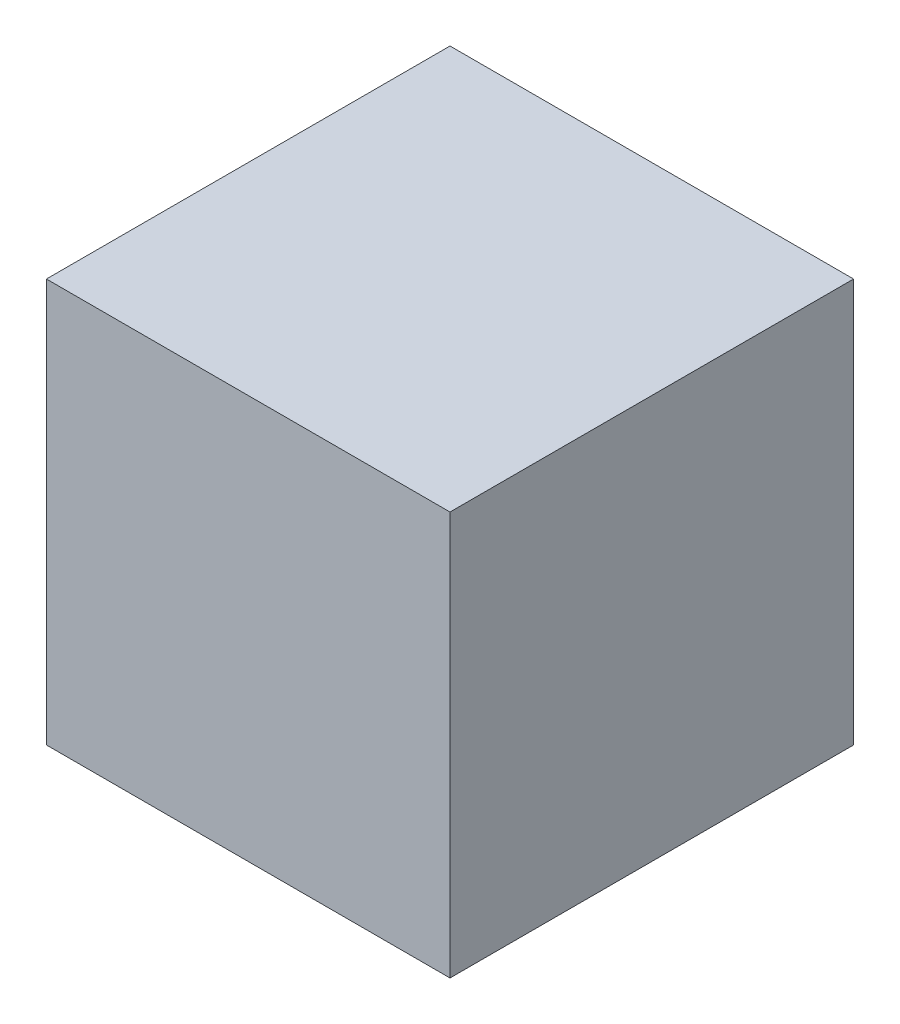
ISO-10303-21;
HEADER;
FILE_DESCRIPTION(('STEP AP214'),'2;1');
FILE_NAME('part.step','',(''),(''),'','','');
FILE_SCHEMA(('AUTOMOTIVE_DESIGN { 1 0 10303 214 1 1 1 1 }'));
ENDSEC;
DATA;
#1=APPLICATION_CONTEXT('core data for automotive mechanical design processes');
#2=APPLICATION_PROTOCOL_DEFINITION('international standard','automotive_design',2000,#1);
#3=PRODUCT_CONTEXT('',#1,'mechanical');
#4=PRODUCT('Part','Part','',(#3));
#5=PRODUCT_RELATED_PRODUCT_CATEGORY('part','',(#4));
#6=PRODUCT_DEFINITION_FORMATION('','',#4);
#7=PRODUCT_DEFINITION_CONTEXT('part definition',#1,'design');
#8=PRODUCT_DEFINITION('design','',#6,#7);
#9=PRODUCT_DEFINITION_SHAPE('','',#8);
#10=(LENGTH_UNIT() NAMED_UNIT(*) SI_UNIT(.MILLI.,.METRE.));
#11=(NAMED_UNIT(*) PLANE_ANGLE_UNIT() SI_UNIT($,.RADIAN.));
#12=(NAMED_UNIT(*) SI_UNIT($,.STERADIAN.) SOLID_ANGLE_UNIT());
#13=UNCERTAINTY_MEASURE_WITH_UNIT(LENGTH_MEASURE(1.E-05),#10,'distance_accuracy_value','');
#14=(GEOMETRIC_REPRESENTATION_CONTEXT(3) GLOBAL_UNCERTAINTY_ASSIGNED_CONTEXT((#13)) GLOBAL_UNIT_ASSIGNED_CONTEXT((#10,
#11,#12)) REPRESENTATION_CONTEXT('',''));
#15=CARTESIAN_POINT('',(0.,0.,0.));
#16=DIRECTION('',(0.,0.,1.));
#17=DIRECTION('',(1.,0.,0.));
#18=AXIS2_PLACEMENT_3D('',#15,#16,#17);
#19=CARTESIAN_POINT('',(0.,29.,0.));
#20=DIRECTION('',(0.,1.,0.));
#21=DIRECTION('',(0.,0.,1.));
#22=AXIS2_PLACEMENT_3D('',#19,#20,#21);
#23=PLANE('',#22);
#24=DIRECTION('',(-1.,0.,0.));
#25=VECTOR('',#24,1.);
#26=CARTESIAN_POINT('',(29.,29.,-29.));
#27=LINE('',#26,#25);
#28=CARTESIAN_POINT('',(-29.,29.,-29.));
#29=VERTEX_POINT('',#28);
#30=CARTESIAN_POINT('',(29.,29.,-29.));
#31=VERTEX_POINT('',#30);
#32=EDGE_CURVE('E68',#29,#31,#27,.F.);
#33=ORIENTED_EDGE('',*,*,#32,.F.);
#34=DIRECTION('',(0.,0.,1.));
#35=VECTOR('',#34,1.);
#36=CARTESIAN_POINT('',(-29.,29.,-29.));
#37=LINE('',#36,#35);
#38=CARTESIAN_POINT('',(-29.,29.,29.));
#39=VERTEX_POINT('',#38);
#40=EDGE_CURVE('E55',#39,#29,#37,.F.);
#41=ORIENTED_EDGE('',*,*,#40,.F.);
#42=DIRECTION('',(1.,0.,0.));
#43=VECTOR('',#42,1.);
#44=CARTESIAN_POINT('',(-29.,29.,29.));
#45=LINE('',#44,#43);
#46=CARTESIAN_POINT('',(29.,29.,29.));
#47=VERTEX_POINT('',#46);
#48=EDGE_CURVE('E20',#47,#39,#45,.F.);
#49=ORIENTED_EDGE('',*,*,#48,.F.);
#50=DIRECTION('',(0.,0.,-1.));
#51=VECTOR('',#50,1.);
#52=CARTESIAN_POINT('',(29.,29.,29.));
#53=LINE('',#52,#51);
#54=EDGE_CURVE('E80',#31,#47,#53,.F.);
#55=ORIENTED_EDGE('',*,*,#54,.F.);
#56=EDGE_LOOP('',(#33,#41,#49,#55));
#57=FACE_BOUND('',#56,.T.);
#58=ADVANCED_FACE('F17',(#57),#23,.T.);
#59=CARTESIAN_POINT('',(-29.,0.,29.));
#60=DIRECTION('',(0.,0.,1.));
#61=DIRECTION('',(1.,0.,0.));
#62=AXIS2_PLACEMENT_3D('',#59,#60,#61);
#63=PLANE('',#62);
#64=DIRECTION('',(0.,1.,0.));
#65=VECTOR('',#64,1.);
#66=CARTESIAN_POINT('',(-29.,0.,29.));
#67=LINE('',#66,#65);
#68=CARTESIAN_POINT('',(-29.,-29.,29.));
#69=VERTEX_POINT('',#68);
#70=EDGE_CURVE('E61',#69,#39,#67,.T.);
#71=ORIENTED_EDGE('',*,*,#70,.F.);
#72=DIRECTION('',(1.,0.,0.));
#73=VECTOR('',#72,1.);
#74=CARTESIAN_POINT('',(0.,-29.,29.));
#75=LINE('',#74,#73);
#76=CARTESIAN_POINT('',(29.,-29.,29.));
#77=VERTEX_POINT('',#76);
#78=EDGE_CURVE('E83',#77,#69,#75,.F.);
#79=ORIENTED_EDGE('',*,*,#78,.F.);
#80=DIRECTION('',(0.,1.,0.));
#81=VECTOR('',#80,1.);
#82=CARTESIAN_POINT('',(29.,0.,29.));
#83=LINE('',#82,#81);
#84=EDGE_CURVE('E64',#47,#77,#83,.F.);
#85=ORIENTED_EDGE('',*,*,#84,.F.);
#86=ORIENTED_EDGE('',*,*,#48,.T.);
#87=EDGE_LOOP('',(#71,#79,#85,#86));
#88=FACE_BOUND('',#87,.T.);
#89=ADVANCED_FACE('F60',(#88),#63,.T.);
#90=CARTESIAN_POINT('',(-29.,0.,-29.));
#91=DIRECTION('',(-1.,0.,0.));
#92=DIRECTION('',(0.,0.,1.));
#93=AXIS2_PLACEMENT_3D('',#90,#91,#92);
#94=PLANE('',#93);
#95=DIRECTION('',(0.,1.,0.));
#96=VECTOR('',#95,1.);
#97=CARTESIAN_POINT('',(-29.,0.,-29.));
#98=LINE('',#97,#96);
#99=CARTESIAN_POINT('',(-29.,-29.,-29.));
#100=VERTEX_POINT('',#99);
#101=EDGE_CURVE('E70',#100,#29,#98,.T.);
#102=ORIENTED_EDGE('',*,*,#101,.F.);
#103=DIRECTION('',(0.,0.,-1.));
#104=VECTOR('',#103,1.);
#105=CARTESIAN_POINT('',(-29.,-29.,0.));
#106=LINE('',#105,#104);
#107=EDGE_CURVE('E74',#69,#100,#106,.T.);
#108=ORIENTED_EDGE('',*,*,#107,.F.);
#109=ORIENTED_EDGE('',*,*,#70,.T.);
#110=ORIENTED_EDGE('',*,*,#40,.T.);
#111=EDGE_LOOP('',(#102,#108,#109,#110));
#112=FACE_BOUND('',#111,.T.);
#113=ADVANCED_FACE('F72',(#112),#94,.T.);
#114=CARTESIAN_POINT('',(29.,0.,-29.));
#115=DIRECTION('',(0.,0.,-1.));
#116=DIRECTION('',(-1.,0.,0.));
#117=AXIS2_PLACEMENT_3D('',#114,#115,#116);
#118=PLANE('',#117);
#119=DIRECTION('',(0.,1.,0.));
#120=VECTOR('',#119,1.);
#121=CARTESIAN_POINT('',(29.,0.,-29.));
#122=LINE('',#121,#120);
#123=CARTESIAN_POINT('',(29.,-29.,-29.));
#124=VERTEX_POINT('',#123);
#125=EDGE_CURVE('E35',#124,#31,#122,.T.);
#126=ORIENTED_EDGE('',*,*,#125,.F.);
#127=DIRECTION('',(1.,0.,0.));
#128=VECTOR('',#127,1.);
#129=CARTESIAN_POINT('',(0.,-29.,-29.));
#130=LINE('',#129,#128);
#131=EDGE_CURVE('E26',#100,#124,#130,.T.);
#132=ORIENTED_EDGE('',*,*,#131,.F.);
#133=ORIENTED_EDGE('',*,*,#101,.T.);
#134=ORIENTED_EDGE('',*,*,#32,.T.);
#135=EDGE_LOOP('',(#126,#132,#133,#134));
#136=FACE_BOUND('',#135,.T.);
#137=ADVANCED_FACE('F89',(#136),#118,.T.);
#138=CARTESIAN_POINT('',(29.,0.,29.));
#139=DIRECTION('',(1.,0.,0.));
#140=DIRECTION('',(0.,0.,-1.));
#141=AXIS2_PLACEMENT_3D('',#138,#139,#140);
#142=PLANE('',#141);
#143=ORIENTED_EDGE('',*,*,#84,.T.);
#144=DIRECTION('',(0.,0.,-1.));
#145=VECTOR('',#144,1.);
#146=CARTESIAN_POINT('',(29.,-29.,0.));
#147=LINE('',#146,#145);
#148=EDGE_CURVE('E11',#124,#77,#147,.F.);
#149=ORIENTED_EDGE('',*,*,#148,.F.);
#150=ORIENTED_EDGE('',*,*,#125,.T.);
#151=ORIENTED_EDGE('',*,*,#54,.T.);
#152=EDGE_LOOP('',(#143,#149,#150,#151));
#153=FACE_BOUND('',#152,.T.);
#154=ADVANCED_FACE('F91',(#153),#142,.T.);
#155=CARTESIAN_POINT('',(0.,-29.,0.));
#156=DIRECTION('',(0.,-1.,0.));
#157=DIRECTION('',(0.,0.,-1.));
#158=AXIS2_PLACEMENT_3D('',#155,#156,#157);
#159=PLANE('',#158);
#160=ORIENTED_EDGE('',*,*,#131,.T.);
#161=ORIENTED_EDGE('',*,*,#148,.T.);
#162=ORIENTED_EDGE('',*,*,#78,.T.);
#163=ORIENTED_EDGE('',*,*,#107,.T.);
#164=EDGE_LOOP('',(#160,#161,#162,#163));
#165=FACE_BOUND('',#164,.T.);
#166=ADVANCED_FACE('F88',(#165),#159,.T.);
#167=CLOSED_SHELL('',(#58,#89,#113,#137,#154,#166));
#168=MANIFOLD_SOLID_BREP('B1',#167);
#169=ADVANCED_BREP_SHAPE_REPRESENTATION('',(#18,#168),#14);
#170=SHAPE_DEFINITION_REPRESENTATION(#9,#169);
ENDSEC;
END-ISO-10303-21;
